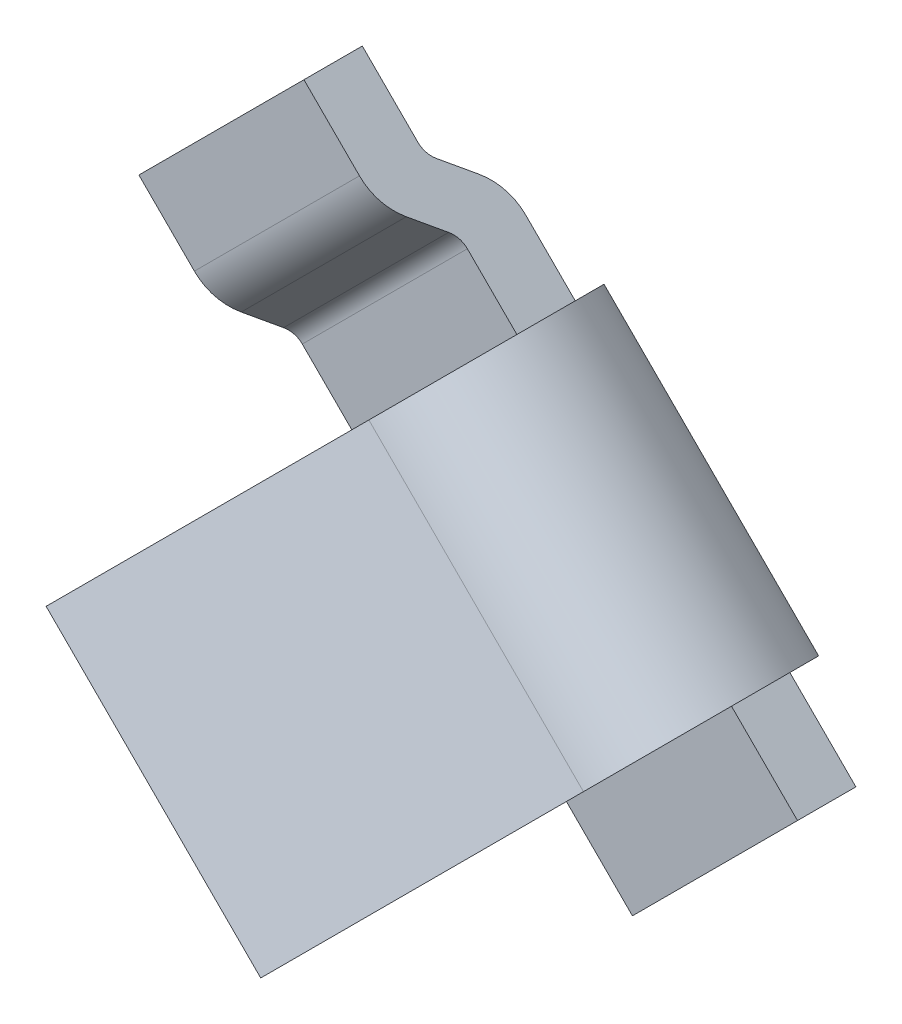
ISO-10303-21;
HEADER;
FILE_DESCRIPTION(('STEP AP214'),'2;1');
FILE_NAME('part.step','',(''),(''),'','','');
FILE_SCHEMA(('AUTOMOTIVE_DESIGN { 1 0 10303 214 1 1 1 1 }'));
ENDSEC;
DATA;
#1=APPLICATION_CONTEXT('core data for automotive mechanical design processes');
#2=APPLICATION_PROTOCOL_DEFINITION('international standard','automotive_design',2000,#1);
#3=PRODUCT_CONTEXT('',#1,'mechanical');
#4=PRODUCT('Part','Part','',(#3));
#5=PRODUCT_RELATED_PRODUCT_CATEGORY('part','',(#4));
#6=PRODUCT_DEFINITION_FORMATION('','',#4);
#7=PRODUCT_DEFINITION_CONTEXT('part definition',#1,'design');
#8=PRODUCT_DEFINITION('design','',#6,#7);
#9=PRODUCT_DEFINITION_SHAPE('','',#8);
#10=(LENGTH_UNIT() NAMED_UNIT(*) SI_UNIT(.MILLI.,.METRE.));
#11=(NAMED_UNIT(*) PLANE_ANGLE_UNIT() SI_UNIT($,.RADIAN.));
#12=(NAMED_UNIT(*) SI_UNIT($,.STERADIAN.) SOLID_ANGLE_UNIT());
#13=UNCERTAINTY_MEASURE_WITH_UNIT(LENGTH_MEASURE(1.E-05),#10,'distance_accuracy_value','');
#14=(GEOMETRIC_REPRESENTATION_CONTEXT(3) GLOBAL_UNCERTAINTY_ASSIGNED_CONTEXT((#13)) GLOBAL_UNIT_ASSIGNED_CONTEXT((#10,
#11,#12)) REPRESENTATION_CONTEXT('',''));
#15=CARTESIAN_POINT('',(0.,0.,0.));
#16=DIRECTION('',(0.,0.,1.));
#17=DIRECTION('',(1.,0.,0.));
#18=AXIS2_PLACEMENT_3D('',#15,#16,#17);
#19=CARTESIAN_POINT('',(5.047182175943,-4.340075394757,0.338523773271));
#20=DIRECTION('',(0.707106781186548,-0.707106781186548,0.));
#21=DIRECTION('',(0.707106781186548,0.707106781186548,0.));
#22=AXIS2_PLACEMENT_3D('',#19,#20,#21);
#23=CYLINDRICAL_SURFACE('',#22,0.3);
#24=CARTESIAN_POINT('',(5.437815621025,-4.730708839839,0.338523773271));
#25=DIRECTION('',(0.707106781186548,-0.707106781186548,0.));
#26=DIRECTION('',(0.707106781186548,0.707106781186548,0.));
#27=AXIS2_PLACEMENT_3D('',#24,#25,#26);
#28=CIRCLE('',#27,0.3);
#29=CARTESIAN_POINT('',(5.437815621025,-4.730708839839,0.038523773271005));
#30=VERTEX_POINT('',#29);
#31=CARTESIAN_POINT('',(5.52746649264412,-4.64105796821988,0.610416109382192));
#32=VERTEX_POINT('',#31);
#33=EDGE_CURVE('E133',#30,#32,#28,.T.);
#34=ORIENTED_EDGE('',*,*,#33,.F.);
#35=DIRECTION('',(0.707106781186933,-0.707106781186163,0.));
#36=VECTOR('',#35,1.);
#37=CARTESIAN_POINT('',(5.437815621025,-4.730708839839,0.03852377327101));
#38=LINE('',#37,#36);
#39=CARTESIAN_POINT('',(6.357054436568,-5.649947655381,0.038523773271005));
#40=VERTEX_POINT('',#39);
#41=EDGE_CURVE('E105',#30,#40,#38,.T.);
#42=ORIENTED_EDGE('',*,*,#41,.T.);
#43=CARTESIAN_POINT('',(6.3570544365675,-5.6499476553815,0.338523773271));
#44=DIRECTION('',(0.707106781186548,-0.707106781186548,0.));
#45=DIRECTION('',(0.707106781186548,0.707106781186548,0.));
#46=AXIS2_PLACEMENT_3D('',#43,#44,#45);
#47=CIRCLE('',#46,0.3);
#48=CARTESIAN_POINT('',(6.44670530818706,-5.56029678376244,0.610416109382178));
#49=VERTEX_POINT('',#48);
#50=EDGE_CURVE('E20',#49,#40,#47,.F.);
#51=ORIENTED_EDGE('',*,*,#50,.F.);
#52=DIRECTION('',(0.707106781186863,-0.707106781186232,-2.08000016782991E-13));
#53=VECTOR('',#52,1.);
#54=CARTESIAN_POINT('',(5.52746649264415,-4.64105796821985,0.610416109382443));
#55=LINE('',#54,#53);
#56=EDGE_CURVE('E92',#32,#49,#55,.T.);
#57=ORIENTED_EDGE('',*,*,#56,.F.);
#58=EDGE_LOOP('',(#34,#42,#51,#57));
#59=FACE_BOUND('',#58,.T.);
#60=ADVANCED_FACE('F17',(#59),#23,.F.);
#61=CARTESIAN_POINT('',(5.613592011514,-6.393410080435,1.159819849645));
#62=DIRECTION('',(-0.298836238729927,-0.298836238729927,-0.906307787036777));
#63=DIRECTION('',(-0.949705125315019,0.,0.313145613014751));
#64=AXIS2_PLACEMENT_3D('',#61,#62,#63);
#65=PLANE('',#64);
#66=DIRECTION('',(-0.707106781186547,0.707106781186547,0.));
#67=VECTOR('',#66,1.);
#68=CARTESIAN_POINT('',(4.69435319597191,-5.47417126489209,1.15981984964473));
#69=LINE('',#68,#67);
#70=CARTESIAN_POINT('',(5.61359201151447,-6.3934100804352,1.15981984964491));
#71=VERTEX_POINT('',#70);
#72=CARTESIAN_POINT('',(4.69435319597197,-5.47417126489203,1.15981984964491));
#73=VERTEX_POINT('',#72);
#74=EDGE_CURVE('E211',#71,#73,#69,.T.);
#75=ORIENTED_EDGE('',*,*,#74,.T.);
#76=DIRECTION('',(-0.640856382055698,-0.640856382055698,0.422618261740976));
#77=VECTOR('',#76,1.);
#78=CARTESIAN_POINT('',(5.527466492644,-4.64105796822,0.610416109382));
#79=LINE('',#78,#77);
#80=EDGE_CURVE('E178',#32,#73,#79,.T.);
#81=ORIENTED_EDGE('',*,*,#80,.F.);
#82=ORIENTED_EDGE('',*,*,#56,.T.);
#83=DIRECTION('',(0.640856382055835,0.640856382055835,-0.422618261740559));
#84=VECTOR('',#83,1.);
#85=CARTESIAN_POINT('',(5.6135920115145,-6.3934100804355,1.159819849645));
#86=LINE('',#85,#84);
#87=EDGE_CURVE('E130',#71,#49,#86,.T.);
#88=ORIENTED_EDGE('',*,*,#87,.F.);
#89=EDGE_LOOP('',(#75,#81,#82,#88));
#90=FACE_BOUND('',#89,.T.);
#91=ADVANCED_FACE('F228',(#90),#65,.T.);
#92=CARTESIAN_POINT('',(4.694353195972,-5.474171264892,1.159819849645));
#93=DIRECTION('',(0.640856382055745,0.640856382055745,-0.422618261740832));
#94=DIRECTION('',(-0.707106781186547,0.707106781186547,0.));
#95=AXIS2_PLACEMENT_3D('',#92,#93,#94);
#96=PLANE('',#95);
#97=DIRECTION('',(-0.29883623873184,-0.29883623873184,-0.906307787035516));
#98=VECTOR('',#97,1.);
#99=CARTESIAN_POINT('',(5.6883010711975,-6.3187010207525,1.386396796404));
#100=LINE('',#99,#98);
#101=CARTESIAN_POINT('',(5.68830107119708,-6.31870102075226,1.38639679640373));
#102=VERTEX_POINT('',#101);
#103=EDGE_CURVE('E132',#102,#71,#100,.T.);
#104=ORIENTED_EDGE('',*,*,#103,.F.);
#105=DIRECTION('',(0.707106781186863,-0.707106781186232,-2.08333617451448E-13));
#106=VECTOR('',#105,1.);
#107=CARTESIAN_POINT('',(4.769062255654,-5.39946220521,1.386396796404));
#108=LINE('',#107,#106);
#109=CARTESIAN_POINT('',(4.769062255654,-5.39946220521,1.386396796404));
#110=VERTEX_POINT('',#109);
#111=EDGE_CURVE('E191',#110,#102,#108,.T.);
#112=ORIENTED_EDGE('',*,*,#111,.F.);
#113=DIRECTION('',(0.298836238728554,0.298836238728554,0.906307787037683));
#114=VECTOR('',#113,1.);
#115=CARTESIAN_POINT('',(4.694353195972,-5.474171264892,1.159819849645));
#116=LINE('',#115,#114);
#117=EDGE_CURVE('E181',#73,#110,#116,.T.);
#118=ORIENTED_EDGE('',*,*,#117,.F.);
#119=ORIENTED_EDGE('',*,*,#74,.F.);
#120=EDGE_LOOP('',(#104,#112,#118,#119));
#121=FACE_BOUND('',#120,.T.);
#122=ADVANCED_FACE('F234',(#121),#96,.F.);
#123=CARTESIAN_POINT('',(5.932790367856,-6.639897149043,0.03852377327101));
#124=DIRECTION('',(0.,0.,-1.));
#125=DIRECTION('',(-1.,0.,0.));
#126=AXIS2_PLACEMENT_3D('',#123,#124,#125);
#127=PLANE('',#126);
#128=ORIENTED_EDGE('',*,*,#41,.F.);
#129=DIRECTION('',(0.707106781186546,-0.707106781186549,0.));
#130=VECTOR('',#129,1.);
#131=CARTESIAN_POINT('',(5.225683586669,-4.518576805483,0.03852377327101));
#132=LINE('',#131,#130);
#133=CARTESIAN_POINT('',(5.22568358666925,-4.51857680548275,0.0385237732710025));
#134=VERTEX_POINT('',#133);
#135=EDGE_CURVE('E134',#134,#30,#132,.T.);
#136=ORIENTED_EDGE('',*,*,#135,.F.);
#137=DIRECTION('',(-0.707106781186548,-0.707106781186548,0.));
#138=VECTOR('',#137,1.);
#139=CARTESIAN_POINT('',(4.518576805483,-5.225683586669,0.0385237732709999));
#140=LINE('',#139,#138);
#141=CARTESIAN_POINT('',(4.51857680548275,-5.22568358666925,0.0385237732710024));
#142=VERTEX_POINT('',#141);
#143=EDGE_CURVE('E340',#134,#142,#140,.T.);
#144=ORIENTED_EDGE('',*,*,#143,.T.);
#145=DIRECTION('',(0.707106781186548,-0.707106781186548,0.));
#146=VECTOR('',#145,1.);
#147=CARTESIAN_POINT('',(4.267766952966,-4.974873734153,0.0385237732710099));
#148=LINE('',#147,#146);
#149=CARTESIAN_POINT('',(5.932790367856,-6.639897149043,0.03852377327101));
#150=VERTEX_POINT('',#149);
#151=EDGE_CURVE('E171',#150,#142,#148,.F.);
#152=ORIENTED_EDGE('',*,*,#151,.F.);
#153=DIRECTION('',(-0.707106781186548,-0.707106781186548,0.));
#154=VECTOR('',#153,1.);
#155=CARTESIAN_POINT('',(6.639897149043,-5.932790367856,0.03852377327101));
#156=LINE('',#155,#154);
#157=CARTESIAN_POINT('',(6.639897149043,-5.932790367856,0.0385237732710099));
#158=VERTEX_POINT('',#157);
#159=EDGE_CURVE('E109',#158,#150,#156,.T.);
#160=ORIENTED_EDGE('',*,*,#159,.F.);
#161=DIRECTION('',(0.707106781186548,-0.707106781186548,0.));
#162=VECTOR('',#161,1.);
#163=CARTESIAN_POINT('',(6.357054436568,-5.649947655381,0.03852377327101));
#164=LINE('',#163,#162);
#165=EDGE_CURVE('E100',#40,#158,#164,.T.);
#166=ORIENTED_EDGE('',*,*,#165,.F.);
#167=EDGE_LOOP('',(#128,#136,#144,#152,#160,#166));
#168=FACE_BOUND('',#167,.T.);
#169=ADVANCED_FACE('F102',(#168),#127,.F.);
#170=CARTESIAN_POINT('',(6.52141436787,-5.48558772408,0.836993056141));
#171=DIRECTION('',(0.707106781186548,-0.707106781186548,0.));
#172=DIRECTION('',(0.707106781186548,0.707106781186548,0.));
#173=AXIS2_PLACEMENT_3D('',#170,#171,#172);
#174=PLANE('',#173);
#175=ORIENTED_EDGE('',*,*,#103,.T.);
#176=ORIENTED_EDGE('',*,*,#87,.T.);
#177=ORIENTED_EDGE('',*,*,#50,.T.);
#178=DIRECTION('',(0.,0.,1.));
#179=VECTOR('',#178,1.);
#180=CARTESIAN_POINT('',(6.357054436568,-5.649947655381,0.25));
#181=LINE('',#180,#179);
#182=CARTESIAN_POINT('',(6.35705443656825,-5.64994765538125,-0.211476226729));
#183=VERTEX_POINT('',#182);
#184=EDGE_CURVE('E116',#183,#40,#181,.T.);
#185=ORIENTED_EDGE('',*,*,#184,.F.);
#186=CARTESIAN_POINT('',(6.357054436568,-5.649947655382,0.338523773271));
#187=DIRECTION('',(0.707106781186548,-0.707106781186548,0.));
#188=DIRECTION('',(0.707106781186548,0.707106781186548,0.));
#189=AXIS2_PLACEMENT_3D('',#186,#187,#188);
#190=CIRCLE('',#189,0.55);
#191=CARTESIAN_POINT('',(6.52141436786976,-5.48558772408024,0.8369930561412));
#192=VERTEX_POINT('',#191);
#193=EDGE_CURVE('E161',#192,#183,#190,.F.);
#194=ORIENTED_EDGE('',*,*,#193,.F.);
#195=DIRECTION('',(0.640856382056263,0.640856382055494,-0.422618261740426));
#196=VECTOR('',#195,1.);
#197=CARTESIAN_POINT('',(5.68830107119691,-6.31870102075209,1.38639679640373));
#198=LINE('',#197,#196);
#199=EDGE_CURVE('E199',#102,#192,#198,.T.);
#200=ORIENTED_EDGE('',*,*,#199,.F.);
#201=EDGE_LOOP('',(#175,#176,#177,#185,#194,#200));
#202=FACE_BOUND('',#201,.T.);
#203=ADVANCED_FACE('F129',(#202),#174,.T.);
#204=CARTESIAN_POINT('',(5.527466492644,-4.64105796822,0.610416109382));
#205=DIRECTION('',(-0.707106781186548,0.707106781186548,0.));
#206=DIRECTION('',(-0.707106781186548,-0.707106781186548,0.));
#207=AXIS2_PLACEMENT_3D('',#204,#205,#206);
#208=PLANE('',#207);
#209=ORIENTED_EDGE('',*,*,#117,.T.);
#210=DIRECTION('',(-0.640856382055879,-0.640856382055878,0.422618261740426));
#211=VECTOR('',#210,1.);
#212=CARTESIAN_POINT('',(5.60217555232706,-4.56634890853694,0.836993056141172));
#213=LINE('',#212,#211);
#214=CARTESIAN_POINT('',(5.60217555232676,-4.56634890853724,0.8369930561412));
#215=VERTEX_POINT('',#214);
#216=EDGE_CURVE('E188',#215,#110,#213,.T.);
#217=ORIENTED_EDGE('',*,*,#216,.F.);
#218=CARTESIAN_POINT('',(5.437815621025,-4.730708839839,0.338523773271));
#219=DIRECTION('',(0.707106781186548,-0.707106781186548,0.));
#220=DIRECTION('',(0.707106781186548,0.707106781186548,0.));
#221=AXIS2_PLACEMENT_3D('',#218,#219,#220);
#222=CIRCLE('',#221,0.55);
#223=CARTESIAN_POINT('',(5.437815621025,-4.730708839839,-0.211476226729));
#224=VERTEX_POINT('',#223);
#225=EDGE_CURVE('E158',#224,#215,#222,.T.);
#226=ORIENTED_EDGE('',*,*,#225,.F.);
#227=DIRECTION('',(0.,0.,1.));
#228=VECTOR('',#227,1.);
#229=CARTESIAN_POINT('',(5.437815621025,-4.730708839839,0.610416109382));
#230=LINE('',#229,#228);
#231=EDGE_CURVE('E34',#224,#30,#230,.T.);
#232=ORIENTED_EDGE('',*,*,#231,.T.);
#233=ORIENTED_EDGE('',*,*,#33,.T.);
#234=ORIENTED_EDGE('',*,*,#80,.T.);
#235=EDGE_LOOP('',(#209,#217,#226,#232,#233,#234));
#236=FACE_BOUND('',#235,.T.);
#237=ADVANCED_FACE('F236',(#236),#208,.T.);
#238=CARTESIAN_POINT('',(4.769062255654,-5.39946220521,1.386396796404));
#239=DIRECTION('',(0.298836238729927,0.298836238729927,0.906307787036777));
#240=DIRECTION('',(0.949705125315019,0.,-0.313145613014751));
#241=AXIS2_PLACEMENT_3D('',#238,#239,#240);
#242=PLANE('',#241);
#243=ORIENTED_EDGE('',*,*,#111,.T.);
#244=ORIENTED_EDGE('',*,*,#199,.T.);
#245=DIRECTION('',(0.707106781186548,-0.707106781186548,0.));
#246=VECTOR('',#245,1.);
#247=CARTESIAN_POINT('',(5.21154210724497,-4.17571546345504,0.836993056140894));
#248=LINE('',#247,#246);
#249=EDGE_CURVE('E160',#215,#192,#248,.T.);
#250=ORIENTED_EDGE('',*,*,#249,.F.);
#251=ORIENTED_EDGE('',*,*,#216,.T.);
#252=EDGE_LOOP('',(#243,#244,#250,#251));
#253=FACE_BOUND('',#252,.T.);
#254=ADVANCED_FACE('F241',(#253),#242,.T.);
#255=CARTESIAN_POINT('',(1.267083322705,-7.5,21.289254270812));
#256=DIRECTION('',(0.707106781186548,-0.707106781186548,0.));
#257=DIRECTION('',(0.707106781186548,0.707106781186548,0.));
#258=AXIS2_PLACEMENT_3D('',#255,#256,#257);
#259=PLANE('',#258);
#260=DIRECTION('',(0.707106781186548,0.707106781186548,0.));
#261=VECTOR('',#260,1.);
#262=CARTESIAN_POINT('',(4.029988270759,-4.737095051946,0.));
#263=LINE('',#262,#261);
#264=CARTESIAN_POINT('',(4.029988270759,-4.737095051946,0.));
#265=VERTEX_POINT('',#264);
#266=CARTESIAN_POINT('',(4.737095051946,-4.029988270759,0.));
#267=VERTEX_POINT('',#266);
#268=EDGE_CURVE('E326',#265,#267,#263,.T.);
#269=ORIENTED_EDGE('',*,*,#268,.F.);
#270=DIRECTION('',(0.,0.,1.));
#271=VECTOR('',#270,1.);
#272=CARTESIAN_POINT('',(4.029988270759,-4.737095051946,0.25));
#273=LINE('',#272,#271);
#274=CARTESIAN_POINT('',(4.029988270759,-4.737095051946,0.25));
#275=VERTEX_POINT('',#274);
#276=EDGE_CURVE('E204',#275,#265,#273,.F.);
#277=ORIENTED_EDGE('',*,*,#276,.F.);
#278=DIRECTION('',(0.707106781186548,0.707106781186548,0.));
#279=VECTOR('',#278,1.);
#280=CARTESIAN_POINT('',(4.029988270759,-4.737095051946,0.25));
#281=LINE('',#280,#279);
#282=CARTESIAN_POINT('',(4.737095051946,-4.029988270759,0.25));
#283=VERTEX_POINT('',#282);
#284=EDGE_CURVE('E201',#275,#283,#281,.T.);
#285=ORIENTED_EDGE('',*,*,#284,.T.);
#286=DIRECTION('',(0.,0.,1.));
#287=VECTOR('',#286,1.);
#288=CARTESIAN_POINT('',(4.737095051946,-4.029988270759,0.25));
#289=LINE('',#288,#287);
#290=EDGE_CURVE('E195',#267,#283,#289,.T.);
#291=ORIENTED_EDGE('',*,*,#290,.F.);
#292=EDGE_LOOP('',(#269,#277,#285,#291));
#293=FACE_BOUND('',#292,.T.);
#294=ADVANCED_FACE('F353',(#293),#259,.F.);
#295=CARTESIAN_POINT('',(3.207106781187,-2.5,0.25));
#296=DIRECTION('',(0.,0.,-1.));
#297=DIRECTION('',(-1.,0.,0.));
#298=AXIS2_PLACEMENT_3D('',#295,#296,#297);
#299=PLANE('',#298);
#300=ORIENTED_EDGE('',*,*,#284,.F.);
#301=DIRECTION('',(0.707106781186548,-0.707106781186548,0.));
#302=VECTOR('',#301,1.);
#303=CARTESIAN_POINT('',(4.267766952966,-4.974873734153,0.25));
#304=LINE('',#303,#302);
#305=CARTESIAN_POINT('',(4.267766952966,-4.974873734153,0.25));
#306=VERTEX_POINT('',#305);
#307=EDGE_CURVE('E166',#306,#275,#304,.F.);
#308=ORIENTED_EDGE('',*,*,#307,.F.);
#309=DIRECTION('',(-0.707106781186548,-0.707106781186548,0.));
#310=VECTOR('',#309,1.);
#311=CARTESIAN_POINT('',(4.267766952966,-4.974873734153,0.25));
#312=LINE('',#311,#310);
#313=CARTESIAN_POINT('',(4.974873734153,-4.267766952966,0.25));
#314=VERTEX_POINT('',#313);
#315=EDGE_CURVE('E346',#314,#306,#312,.T.);
#316=ORIENTED_EDGE('',*,*,#315,.F.);
#317=DIRECTION('',(-0.707106781186548,0.707106781186548,0.));
#318=VECTOR('',#317,1.);
#319=CARTESIAN_POINT('',(3.207106781187,-2.5,0.25));
#320=LINE('',#319,#318);
#321=EDGE_CURVE('E157',#283,#314,#320,.F.);
#322=ORIENTED_EDGE('',*,*,#321,.F.);
#323=EDGE_LOOP('',(#300,#308,#316,#322));
#324=FACE_BOUND('',#323,.T.);
#325=ADVANCED_FACE('F356',(#324),#299,.F.);
#326=CARTESIAN_POINT('',(4.267766952966,-4.974873734153,0.));
#327=DIRECTION('',(-0.707106781186548,-0.707106781186548,0.));
#328=DIRECTION('',(0.707106781186548,-0.707106781186548,0.));
#329=AXIS2_PLACEMENT_3D('',#326,#327,#328);
#330=CYLINDRICAL_SURFACE('',#329,0.25);
#331=CARTESIAN_POINT('',(4.267766952966,-4.974873734153,0.));
#332=DIRECTION('',(-0.707106781186548,-0.707106781186548,0.));
#333=DIRECTION('',(0.707106781186548,-0.707106781186548,0.));
#334=AXIS2_PLACEMENT_3D('',#331,#332,#333);
#335=CIRCLE('',#334,0.25);
#336=CARTESIAN_POINT('',(4.39378554514773,-5.10089232633473,0.175324353268384));
#337=VERTEX_POINT('',#336);
#338=EDGE_CURVE('E163',#337,#306,#335,.T.);
#339=ORIENTED_EDGE('',*,*,#338,.F.);
#340=DIRECTION('',(0.707106781186547,0.707106781186547,0.));
#341=VECTOR('',#340,1.);
#342=CARTESIAN_POINT('',(4.393785545148,-5.100892326335,0.175324353268));
#343=LINE('',#342,#341);
#344=CARTESIAN_POINT('',(5.10089232633473,-4.39378554514773,0.175324353268384));
#345=VERTEX_POINT('',#344);
#346=EDGE_CURVE('E343',#337,#345,#343,.T.);
#347=ORIENTED_EDGE('',*,*,#346,.T.);
#348=CARTESIAN_POINT('',(4.974873734153,-4.267766952966,0.));
#349=DIRECTION('',(-0.707106781186548,-0.707106781186548,0.));
#350=DIRECTION('',(0.707106781186548,-0.707106781186548,0.));
#351=AXIS2_PLACEMENT_3D('',#348,#349,#350);
#352=CIRCLE('',#351,0.25);
#353=EDGE_CURVE('E154',#314,#345,#352,.F.);
#354=ORIENTED_EDGE('',*,*,#353,.F.);
#355=ORIENTED_EDGE('',*,*,#315,.T.);
#356=EDGE_LOOP('',(#339,#347,#354,#355));
#357=FACE_BOUND('',#356,.T.);
#358=ADVANCED_FACE('F394',(#357),#330,.T.);
#359=CARTESIAN_POINT('',(4.393785545148,-5.100892326335,0.175324353268));
#360=DIRECTION('',(-0.504074368727168,0.504074368727168,-0.701297413074234));
#361=DIRECTION('',(-0.812006123349613,0.,0.583648914710491));
#362=AXIS2_PLACEMENT_3D('',#359,#360,#361);
#363=PLANE('',#362);
#364=ORIENTED_EDGE('',*,*,#346,.F.);
#365=DIRECTION('',(-0.495892156414326,0.495892156414326,0.712868808697294));
#366=VECTOR('',#365,1.);
#367=CARTESIAN_POINT('',(4.46816936861,-5.175276149797,0.06839403196362));
#368=LINE('',#367,#366);
#369=CARTESIAN_POINT('',(4.46816936861022,-5.17527614979672,0.0683940319635747));
#370=VERTEX_POINT('',#369);
#371=EDGE_CURVE('E167',#370,#337,#368,.T.);
#372=ORIENTED_EDGE('',*,*,#371,.F.);
#373=DIRECTION('',(-0.707106781186548,-0.707106781186548,0.));
#374=VECTOR('',#373,1.);
#375=CARTESIAN_POINT('',(4.46816936861037,-5.17527614979637,0.0683940319634451));
#376=LINE('',#375,#374);
#377=CARTESIAN_POINT('',(5.17527614979694,-4.46816936860994,0.0683940319635312));
#378=VERTEX_POINT('',#377);
#379=EDGE_CURVE('E336',#370,#378,#376,.F.);
#380=ORIENTED_EDGE('',*,*,#379,.T.);
#381=DIRECTION('',(0.495892156414326,-0.495892156414326,-0.712868808697294));
#382=VECTOR('',#381,1.);
#383=CARTESIAN_POINT('',(5.100892326335,-4.393785545148,0.175324353268));
#384=LINE('',#383,#382);
#385=EDGE_CURVE('E153',#345,#378,#384,.T.);
#386=ORIENTED_EDGE('',*,*,#385,.F.);
#387=EDGE_LOOP('',(#364,#372,#380,#386));
#388=FACE_BOUND('',#387,.T.);
#389=ADVANCED_FACE('F398',(#388),#363,.F.);
#390=CARTESIAN_POINT('',(4.518576805483,-5.225683586669,0.138523773271));
#391=DIRECTION('',(-0.707106781186548,-0.707106781186548,0.));
#392=DIRECTION('',(0.707106781186548,-0.707106781186548,0.));
#393=AXIS2_PLACEMENT_3D('',#390,#391,#392);
#394=CYLINDRICAL_SURFACE('',#393,0.1);
#395=ORIENTED_EDGE('',*,*,#379,.F.);
#396=CARTESIAN_POINT('',(4.518576805483,-5.225683586669,0.138523773271));
#397=DIRECTION('',(-0.707106781186548,-0.707106781186548,0.));
#398=DIRECTION('',(0.707106781186548,-0.707106781186548,0.));
#399=AXIS2_PLACEMENT_3D('',#396,#397,#398);
#400=CIRCLE('',#399,0.1);
#401=EDGE_CURVE('E168',#142,#370,#400,.F.);
#402=ORIENTED_EDGE('',*,*,#401,.F.);
#403=ORIENTED_EDGE('',*,*,#143,.F.);
#404=CARTESIAN_POINT('',(5.2256835866695,-4.5185768054825,0.138523773271));
#405=DIRECTION('',(-0.707106781186548,-0.707106781186548,0.));
#406=DIRECTION('',(0.707106781186548,-0.707106781186548,0.));
#407=AXIS2_PLACEMENT_3D('',#404,#405,#406);
#408=CIRCLE('',#407,0.1);
#409=EDGE_CURVE('E150',#378,#134,#408,.T.);
#410=ORIENTED_EDGE('',*,*,#409,.F.);
#411=EDGE_LOOP('',(#395,#402,#403,#410));
#412=FACE_BOUND('',#411,.T.);
#413=ADVANCED_FACE('F402',(#412),#394,.F.);
#414=CARTESIAN_POINT('',(4.318174389839,-5.025281171026,-0.02987025869261));
#415=DIRECTION('',(0.504074368727168,-0.504074368727168,0.701297413074234));
#416=DIRECTION('',(0.812006123349613,0.,-0.58364891471049));
#417=AXIS2_PLACEMENT_3D('',#414,#415,#416);
#418=PLANE('',#417);
#419=DIRECTION('',(-0.707106781186548,-0.707106781186548,0.));
#420=VECTOR('',#419,1.);
#421=CARTESIAN_POINT('',(4.39255821330116,-5.09966499448716,-0.136800579997477));
#422=LINE('',#421,#420);
#423=CARTESIAN_POINT('',(4.3925582133013,-5.0996649944878,-0.136800579997319));
#424=VERTEX_POINT('',#423);
#425=CARTESIAN_POINT('',(5.09966499448797,-4.39255821330097,-0.136800579997438));
#426=VERTEX_POINT('',#425);
#427=EDGE_CURVE('E207',#424,#426,#422,.F.);
#428=ORIENTED_EDGE('',*,*,#427,.F.);
#429=DIRECTION('',(0.495892156414302,-0.495892156414302,-0.712868808697327));
#430=VECTOR('',#429,1.);
#431=CARTESIAN_POINT('',(4.318174389839,-5.025281171026,-0.0298702586926101));
#432=LINE('',#431,#430);
#433=CARTESIAN_POINT('',(4.31817438983881,-5.02528117102581,-0.0298702586925278));
#434=VERTEX_POINT('',#433);
#435=EDGE_CURVE('E174',#434,#424,#432,.T.);
#436=ORIENTED_EDGE('',*,*,#435,.F.);
#437=DIRECTION('',(-0.707106781186548,-0.707106781186548,0.));
#438=VECTOR('',#437,1.);
#439=CARTESIAN_POINT('',(4.31817438983887,-5.02528117102587,-0.0298702586927941));
#440=LINE('',#439,#438);
#441=CARTESIAN_POINT('',(5.02528117102581,-4.31817438983881,-0.0298702586925277));
#442=VERTEX_POINT('',#441);
#443=EDGE_CURVE('E328',#434,#442,#440,.F.);
#444=ORIENTED_EDGE('',*,*,#443,.T.);
#445=DIRECTION('',(-0.495892156414302,0.495892156414302,0.712868808697327));
#446=VECTOR('',#445,1.);
#447=CARTESIAN_POINT('',(5.099664994488,-4.392558213301,-0.136800579997));
#448=LINE('',#447,#446);
#449=EDGE_CURVE('E146',#426,#442,#448,.T.);
#450=ORIENTED_EDGE('',*,*,#449,.F.);
#451=EDGE_LOOP('',(#428,#436,#444,#450));
#452=FACE_BOUND('',#451,.T.);
#453=ADVANCED_FACE('F382',(#452),#418,.F.);
#454=CARTESIAN_POINT('',(4.267766952966,-4.974873734153,-0.1));
#455=DIRECTION('',(-0.707106781186548,-0.707106781186548,0.));
#456=DIRECTION('',(0.707106781186548,-0.707106781186548,0.));
#457=AXIS2_PLACEMENT_3D('',#454,#455,#456);
#458=CYLINDRICAL_SURFACE('',#457,0.1);
#459=ORIENTED_EDGE('',*,*,#443,.F.);
#460=CARTESIAN_POINT('',(4.267766952966,-4.974873734153,-0.1));
#461=DIRECTION('',(-0.707106781186548,-0.707106781186548,0.));
#462=DIRECTION('',(0.707106781186548,-0.707106781186548,0.));
#463=AXIS2_PLACEMENT_3D('',#460,#461,#462);
#464=CIRCLE('',#463,0.1);
#465=CARTESIAN_POINT('',(4.267766952966,-4.974873734153,0.));
#466=VERTEX_POINT('',#465);
#467=EDGE_CURVE('E175',#466,#434,#464,.F.);
#468=ORIENTED_EDGE('',*,*,#467,.F.);
#469=DIRECTION('',(-0.707106781186547,-0.707106781186547,0.));
#470=VECTOR('',#469,1.);
#471=CARTESIAN_POINT('',(4.974873734153,-4.267766952966,0.));
#472=LINE('',#471,#470);
#473=CARTESIAN_POINT('',(4.974873734153,-4.267766952966,0.));
#474=VERTEX_POINT('',#473);
#475=EDGE_CURVE('E324',#474,#466,#472,.T.);
#476=ORIENTED_EDGE('',*,*,#475,.F.);
#477=CARTESIAN_POINT('',(4.974873734153,-4.267766952966,-0.1));
#478=DIRECTION('',(-0.707106781186548,-0.707106781186548,0.));
#479=DIRECTION('',(0.707106781186548,-0.707106781186548,0.));
#480=AXIS2_PLACEMENT_3D('',#477,#478,#479);
#481=CIRCLE('',#480,0.1);
#482=EDGE_CURVE('E142',#442,#474,#481,.T.);
#483=ORIENTED_EDGE('',*,*,#482,.F.);
#484=EDGE_LOOP('',(#459,#468,#476,#483));
#485=FACE_BOUND('',#484,.T.);
#486=ADVANCED_FACE('F385',(#485),#458,.F.);
#487=CARTESIAN_POINT('',(3.207106781187,-2.5,0.));
#488=DIRECTION('',(0.,0.,-1.));
#489=DIRECTION('',(-1.,0.,0.));
#490=AXIS2_PLACEMENT_3D('',#487,#488,#489);
#491=PLANE('',#490);
#492=ORIENTED_EDGE('',*,*,#475,.T.);
#493=DIRECTION('',(0.707106781186548,-0.707106781186548,0.));
#494=VECTOR('',#493,1.);
#495=CARTESIAN_POINT('',(4.267766952966,-4.974873734153,0.));
#496=LINE('',#495,#494);
#497=EDGE_CURVE('E177',#265,#466,#496,.T.);
#498=ORIENTED_EDGE('',*,*,#497,.F.);
#499=ORIENTED_EDGE('',*,*,#268,.T.);
#500=DIRECTION('',(-0.707106781186548,0.707106781186548,0.));
#501=VECTOR('',#500,1.);
#502=CARTESIAN_POINT('',(3.207106781187,-2.5,0.));
#503=LINE('',#502,#501);
#504=EDGE_CURVE('E145',#474,#267,#503,.T.);
#505=ORIENTED_EDGE('',*,*,#504,.F.);
#506=EDGE_LOOP('',(#492,#498,#499,#505));
#507=FACE_BOUND('',#506,.T.);
#508=ADVANCED_FACE('F388',(#507),#491,.T.);
#509=CARTESIAN_POINT('',(4.518576805483,-5.225683586669,0.03852377327101));
#510=DIRECTION('',(-0.707106781186548,-0.707106781186548,0.));
#511=DIRECTION('',(0.707106781186548,-0.707106781186548,0.));
#512=AXIS2_PLACEMENT_3D('',#509,#510,#511);
#513=CYLINDRICAL_SURFACE('',#512,0.25);
#514=CARTESIAN_POINT('',(4.518576805483,-5.225683586669,0.03852377327101));
#515=DIRECTION('',(-0.707106781186548,-0.707106781186548,0.));
#516=DIRECTION('',(0.707106781186548,-0.707106781186548,0.));
#517=AXIS2_PLACEMENT_3D('',#514,#515,#516);
#518=CIRCLE('',#517,0.25);
#519=CARTESIAN_POINT('',(4.518576805483,-5.225683586669,-0.211476226729));
#520=VERTEX_POINT('',#519);
#521=EDGE_CURVE('E172',#424,#520,#518,.T.);
#522=ORIENTED_EDGE('',*,*,#521,.F.);
#523=ORIENTED_EDGE('',*,*,#427,.T.);
#524=CARTESIAN_POINT('',(5.2256835866695,-4.5185768054825,0.03852377327101));
#525=DIRECTION('',(-0.707106781186548,-0.707106781186548,0.));
#526=DIRECTION('',(0.707106781186548,-0.707106781186548,0.));
#527=AXIS2_PLACEMENT_3D('',#524,#525,#526);
#528=CIRCLE('',#527,0.25);
#529=CARTESIAN_POINT('',(5.22568358666925,-4.51857680548275,-0.211476226729));
#530=VERTEX_POINT('',#529);
#531=EDGE_CURVE('E147',#530,#426,#528,.F.);
#532=ORIENTED_EDGE('',*,*,#531,.F.);
#533=DIRECTION('',(-0.707106781186548,-0.707106781186548,0.));
#534=VECTOR('',#533,1.);
#535=CARTESIAN_POINT('',(5.225683586669,-4.518576805483,-0.211476226729));
#536=LINE('',#535,#534);
#537=EDGE_CURVE('E298',#530,#520,#536,.T.);
#538=ORIENTED_EDGE('',*,*,#537,.T.);
#539=EDGE_LOOP('',(#522,#523,#532,#538));
#540=FACE_BOUND('',#539,.T.);
#541=ADVANCED_FACE('F403',(#540),#513,.T.);
#542=CARTESIAN_POINT('',(4.267766952966,-4.974873734153,0.25));
#543=DIRECTION('',(-0.707106781186548,-0.707106781186548,0.));
#544=DIRECTION('',(0.707106781186548,-0.707106781186548,0.));
#545=AXIS2_PLACEMENT_3D('',#542,#543,#544);
#546=PLANE('',#545);
#547=ORIENTED_EDGE('',*,*,#338,.T.);
#548=ORIENTED_EDGE('',*,*,#307,.T.);
#549=ORIENTED_EDGE('',*,*,#276,.T.);
#550=ORIENTED_EDGE('',*,*,#497,.T.);
#551=ORIENTED_EDGE('',*,*,#467,.T.);
#552=ORIENTED_EDGE('',*,*,#435,.T.);
#553=ORIENTED_EDGE('',*,*,#521,.T.);
#554=DIRECTION('',(0.707106781186298,-0.707106781186797,0.));
#555=VECTOR('',#554,1.);
#556=CARTESIAN_POINT('',(4.518576805483,-5.225683586669,-0.211476226729));
#557=LINE('',#556,#555);
#558=CARTESIAN_POINT('',(5.932790367856,-6.639897149043,-0.211476226729));
#559=VERTEX_POINT('',#558);
#560=EDGE_CURVE('E296',#520,#559,#557,.T.);
#561=ORIENTED_EDGE('',*,*,#560,.T.);
#562=DIRECTION('',(0.,0.,1.));
#563=VECTOR('',#562,1.);
#564=CARTESIAN_POINT('',(5.932790367856,-6.639897149043,0.03852377327101));
#565=LINE('',#564,#563);
#566=EDGE_CURVE('E125',#559,#150,#565,.T.);
#567=ORIENTED_EDGE('',*,*,#566,.T.);
#568=ORIENTED_EDGE('',*,*,#151,.T.);
#569=ORIENTED_EDGE('',*,*,#401,.T.);
#570=ORIENTED_EDGE('',*,*,#371,.T.);
#571=EDGE_LOOP('',(#547,#548,#549,#550,#551,#552,#553,#561,#567,#568,#569,#570));
#572=FACE_BOUND('',#571,.T.);
#573=ADVANCED_FACE('F390',(#572),#546,.T.);
#574=CARTESIAN_POINT('',(5.932790367856,-6.639897149043,0.03852377327101));
#575=DIRECTION('',(-0.707106781186548,0.707106781186548,0.));
#576=DIRECTION('',(-0.707106781186548,-0.707106781186548,0.));
#577=AXIS2_PLACEMENT_3D('',#574,#575,#576);
#578=PLANE('',#577);
#579=ORIENTED_EDGE('',*,*,#159,.T.);
#580=ORIENTED_EDGE('',*,*,#566,.F.);
#581=DIRECTION('',(0.707106781186548,0.707106781186548,0.));
#582=VECTOR('',#581,1.);
#583=CARTESIAN_POINT('',(5.932790367856,-6.639897149043,-0.211476226729));
#584=LINE('',#583,#582);
#585=CARTESIAN_POINT('',(6.639897149043,-5.932790367856,-0.211476226729));
#586=VERTEX_POINT('',#585);
#587=EDGE_CURVE('E290',#559,#586,#584,.T.);
#588=ORIENTED_EDGE('',*,*,#587,.T.);
#589=DIRECTION('',(0.,0.,1.));
#590=VECTOR('',#589,1.);
#591=CARTESIAN_POINT('',(6.639897149043,-5.932790367856,0.25));
#592=LINE('',#591,#590);
#593=EDGE_CURVE('E124',#158,#586,#592,.F.);
#594=ORIENTED_EDGE('',*,*,#593,.F.);
#595=EDGE_LOOP('',(#579,#580,#588,#594));
#596=FACE_BOUND('',#595,.T.);
#597=ADVANCED_FACE('F294',(#596),#578,.F.);
#598=CARTESIAN_POINT('',(3.207106781187,-2.5,0.25));
#599=DIRECTION('',(0.707106781186548,0.707106781186548,0.));
#600=DIRECTION('',(-0.707106781186548,0.707106781186548,0.));
#601=AXIS2_PLACEMENT_3D('',#598,#599,#600);
#602=PLANE('',#601);
#603=ORIENTED_EDGE('',*,*,#593,.T.);
#604=DIRECTION('',(-0.707106781186548,0.707106781186548,0.));
#605=VECTOR('',#604,1.);
#606=CARTESIAN_POINT('',(6.639897149043,-5.932790367856,-0.211476226729));
#607=LINE('',#606,#605);
#608=EDGE_CURVE('E120',#586,#183,#607,.T.);
#609=ORIENTED_EDGE('',*,*,#608,.T.);
#610=ORIENTED_EDGE('',*,*,#184,.T.);
#611=ORIENTED_EDGE('',*,*,#165,.T.);
#612=EDGE_LOOP('',(#603,#609,#610,#611));
#613=FACE_BOUND('',#612,.T.);
#614=ADVANCED_FACE('F118',(#613),#602,.T.);
#615=CARTESIAN_POINT('',(5.047182175943,-4.340075394757,0.338523773271));
#616=DIRECTION('',(0.707106781186548,-0.707106781186548,0.));
#617=DIRECTION('',(0.707106781186548,0.707106781186548,0.));
#618=AXIS2_PLACEMENT_3D('',#615,#616,#617);
#619=CYLINDRICAL_SURFACE('',#618,0.55);
#620=ORIENTED_EDGE('',*,*,#225,.T.);
#621=ORIENTED_EDGE('',*,*,#249,.T.);
#622=ORIENTED_EDGE('',*,*,#193,.T.);
#623=DIRECTION('',(-0.707106781186933,0.707106781186163,0.));
#624=VECTOR('',#623,1.);
#625=CARTESIAN_POINT('',(6.357054436568,-5.649947655381,-0.211476226729));
#626=LINE('',#625,#624);
#627=EDGE_CURVE('E26',#183,#224,#626,.T.);
#628=ORIENTED_EDGE('',*,*,#627,.T.);
#629=EDGE_LOOP('',(#620,#621,#622,#628));
#630=FACE_BOUND('',#629,.T.);
#631=ADVANCED_FACE('F244',(#630),#619,.T.);
#632=CARTESIAN_POINT('',(3.207106781187,-2.5,0.25));
#633=DIRECTION('',(0.707106781186548,0.707106781186548,0.));
#634=DIRECTION('',(-0.707106781186548,0.707106781186548,0.));
#635=AXIS2_PLACEMENT_3D('',#632,#633,#634);
#636=PLANE('',#635);
#637=ORIENTED_EDGE('',*,*,#482,.T.);
#638=ORIENTED_EDGE('',*,*,#504,.T.);
#639=ORIENTED_EDGE('',*,*,#290,.T.);
#640=ORIENTED_EDGE('',*,*,#321,.T.);
#641=ORIENTED_EDGE('',*,*,#353,.T.);
#642=ORIENTED_EDGE('',*,*,#385,.T.);
#643=ORIENTED_EDGE('',*,*,#409,.T.);
#644=ORIENTED_EDGE('',*,*,#135,.T.);
#645=ORIENTED_EDGE('',*,*,#231,.F.);
#646=DIRECTION('',(-0.707106781186546,0.707106781186549,0.));
#647=VECTOR('',#646,1.);
#648=CARTESIAN_POINT('',(5.437815621025,-4.730708839839,-0.211476226729));
#649=LINE('',#648,#647);
#650=EDGE_CURVE('E11',#224,#530,#649,.T.);
#651=ORIENTED_EDGE('',*,*,#650,.T.);
#652=ORIENTED_EDGE('',*,*,#531,.T.);
#653=ORIENTED_EDGE('',*,*,#449,.T.);
#654=EDGE_LOOP('',(#637,#638,#639,#640,#641,#642,#643,#644,#645,#651,#652,#653));
#655=FACE_BOUND('',#654,.T.);
#656=ADVANCED_FACE('F376',(#655),#636,.T.);
#657=CARTESIAN_POINT('',(5.932790367856,-6.639897149043,-0.211476226729));
#658=DIRECTION('',(0.,0.,1.));
#659=DIRECTION('',(1.,0.,0.));
#660=AXIS2_PLACEMENT_3D('',#657,#658,#659);
#661=PLANE('',#660);
#662=ORIENTED_EDGE('',*,*,#627,.F.);
#663=ORIENTED_EDGE('',*,*,#608,.F.);
#664=ORIENTED_EDGE('',*,*,#587,.F.);
#665=ORIENTED_EDGE('',*,*,#560,.F.);
#666=ORIENTED_EDGE('',*,*,#537,.F.);
#667=ORIENTED_EDGE('',*,*,#650,.F.);
#668=EDGE_LOOP('',(#662,#663,#664,#665,#666,#667));
#669=FACE_BOUND('',#668,.T.);
#670=ADVANCED_FACE('F288',(#669),#661,.F.);
#671=CLOSED_SHELL('',(#60,#91,#122,#169,#203,#237,#254,#294,#325,#358,#389,#413,#453,#486,#508,
#541,#573,#597,#614,#631,#656,#670));
#672=MANIFOLD_SOLID_BREP('B1',#671);
#673=ADVANCED_BREP_SHAPE_REPRESENTATION('',(#18,#672),#14);
#674=SHAPE_DEFINITION_REPRESENTATION(#9,#673);
ENDSEC;
END-ISO-10303-21;
